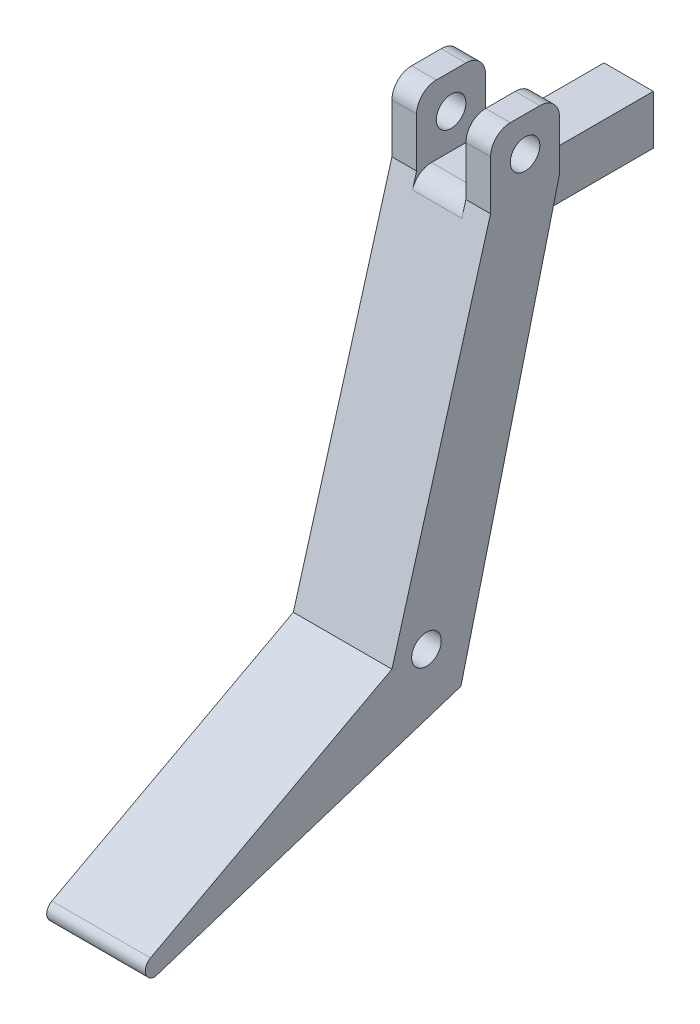
ISO-10303-21;
HEADER;
FILE_DESCRIPTION(('STEP AP214'),'2;1');
FILE_NAME('part.step','',(''),(''),'','','');
FILE_SCHEMA(('AUTOMOTIVE_DESIGN { 1 0 10303 214 1 1 1 1 }'));
ENDSEC;
DATA;
#1=APPLICATION_CONTEXT('core data for automotive mechanical design processes');
#2=APPLICATION_PROTOCOL_DEFINITION('international standard','automotive_design',2000,#1);
#3=PRODUCT_CONTEXT('',#1,'mechanical');
#4=PRODUCT('Part','Part','',(#3));
#5=PRODUCT_RELATED_PRODUCT_CATEGORY('part','',(#4));
#6=PRODUCT_DEFINITION_FORMATION('','',#4);
#7=PRODUCT_DEFINITION_CONTEXT('part definition',#1,'design');
#8=PRODUCT_DEFINITION('design','',#6,#7);
#9=PRODUCT_DEFINITION_SHAPE('','',#8);
#10=(LENGTH_UNIT() NAMED_UNIT(*) SI_UNIT(.MILLI.,.METRE.));
#11=(NAMED_UNIT(*) PLANE_ANGLE_UNIT() SI_UNIT($,.RADIAN.));
#12=(NAMED_UNIT(*) SI_UNIT($,.STERADIAN.) SOLID_ANGLE_UNIT());
#13=UNCERTAINTY_MEASURE_WITH_UNIT(LENGTH_MEASURE(1.E-05),#10,'distance_accuracy_value','');
#14=(GEOMETRIC_REPRESENTATION_CONTEXT(3) GLOBAL_UNCERTAINTY_ASSIGNED_CONTEXT((#13)) GLOBAL_UNIT_ASSIGNED_CONTEXT((#10,
#11,#12)) REPRESENTATION_CONTEXT('',''));
#15=CARTESIAN_POINT('',(0.,0.,0.));
#16=DIRECTION('',(0.,0.,1.));
#17=DIRECTION('',(1.,0.,0.));
#18=AXIS2_PLACEMENT_3D('',#15,#16,#17);
#19=CARTESIAN_POINT('',(10.,32.7058823529412,-7.1764705882353));
#20=DIRECTION('',(0.,0.,1.));
#21=DIRECTION('',(1.,0.,0.));
#22=AXIS2_PLACEMENT_3D('',#19,#20,#21);
#23=PLANE('',#22);
#24=DIRECTION('',(0.,1.,0.));
#25=VECTOR('',#24,1.);
#26=CARTESIAN_POINT('',(7.5,32.7058823529412,-7.1764705882353));
#27=LINE('',#26,#25);
#28=CARTESIAN_POINT('',(7.5,32.7058823529412,-7.1764705882353));
#29=VERTEX_POINT('',#28);
#30=CARTESIAN_POINT('',(7.5,37.7058823529412,-7.1764705882353));
#31=VERTEX_POINT('',#30);
#32=EDGE_CURVE('E228',#29,#31,#27,.T.);
#33=ORIENTED_EDGE('',*,*,#32,.T.);
#34=DIRECTION('',(-1.,0.,0.));
#35=VECTOR('',#34,1.);
#36=CARTESIAN_POINT('',(10.,37.7058823529412,-7.1764705882353));
#37=LINE('',#36,#35);
#38=CARTESIAN_POINT('',(10.,37.7058823529412,-7.1764705882353));
#39=VERTEX_POINT('',#38);
#40=EDGE_CURVE('E337',#31,#39,#37,.F.);
#41=ORIENTED_EDGE('',*,*,#40,.T.);
#42=DIRECTION('',(0.,1.,0.));
#43=VECTOR('',#42,1.);
#44=CARTESIAN_POINT('',(10.,32.7058823529412,-7.1764705882353));
#45=LINE('',#44,#43);
#46=CARTESIAN_POINT('',(10.,32.7058823529412,-7.1764705882353));
#47=VERTEX_POINT('',#46);
#48=EDGE_CURVE('E262',#47,#39,#45,.T.);
#49=ORIENTED_EDGE('',*,*,#48,.F.);
#50=DIRECTION('',(-1.,0.,0.));
#51=VECTOR('',#50,1.);
#52=CARTESIAN_POINT('',(10.,32.7058823529412,-7.1764705882353));
#53=LINE('',#52,#51);
#54=EDGE_CURVE('E293',#47,#29,#53,.T.);
#55=ORIENTED_EDGE('',*,*,#54,.T.);
#56=EDGE_LOOP('',(#33,#41,#49,#55));
#57=FACE_BOUND('',#56,.T.);
#58=ADVANCED_FACE('F35',(#57),#23,.F.);
#59=CARTESIAN_POINT('',(10.,39.7058823529412,-7.1764705882353));
#60=DIRECTION('',(0.,-1.,0.));
#61=DIRECTION('',(0.,0.,-1.));
#62=AXIS2_PLACEMENT_3D('',#59,#60,#61);
#63=PLANE('',#62);
#64=DIRECTION('',(0.,0.,-1.));
#65=VECTOR('',#64,1.);
#66=CARTESIAN_POINT('',(7.5,39.7058823529412,-0.176470588235299));
#67=LINE('',#66,#65);
#68=CARTESIAN_POINT('',(7.5,39.7058823529412,-2.1764705882353));
#69=VERTEX_POINT('',#68);
#70=CARTESIAN_POINT('',(7.5,39.7058823529412,-5.1764705882353));
#71=VERTEX_POINT('',#70);
#72=EDGE_CURVE('E220',#69,#71,#67,.T.);
#73=ORIENTED_EDGE('',*,*,#72,.F.);
#74=DIRECTION('',(-1.,0.,0.));
#75=VECTOR('',#74,1.);
#76=CARTESIAN_POINT('',(10.,39.7058823529412,-2.1764705882353));
#77=LINE('',#76,#75);
#78=CARTESIAN_POINT('',(10.,39.7058823529412,-2.1764705882353));
#79=VERTEX_POINT('',#78);
#80=EDGE_CURVE('E331',#69,#79,#77,.F.);
#81=ORIENTED_EDGE('',*,*,#80,.T.);
#82=DIRECTION('',(0.,0.,1.));
#83=VECTOR('',#82,1.);
#84=CARTESIAN_POINT('',(10.,39.7058823529412,-7.1764705882353));
#85=LINE('',#84,#83);
#86=CARTESIAN_POINT('',(10.,39.7058823529412,-5.1764705882353));
#87=VERTEX_POINT('',#86);
#88=EDGE_CURVE('E265',#87,#79,#85,.T.);
#89=ORIENTED_EDGE('',*,*,#88,.F.);
#90=DIRECTION('',(-1.,0.,0.));
#91=VECTOR('',#90,1.);
#92=CARTESIAN_POINT('',(10.,39.7058823529412,-5.1764705882353));
#93=LINE('',#92,#91);
#94=EDGE_CURVE('E328',#87,#71,#93,.T.);
#95=ORIENTED_EDGE('',*,*,#94,.T.);
#96=EDGE_LOOP('',(#73,#81,#89,#95));
#97=FACE_BOUND('',#96,.T.);
#98=ADVANCED_FACE('F386',(#97),#63,.F.);
#99=CARTESIAN_POINT('',(10.,39.7058823529412,-0.176470588235299));
#100=DIRECTION('',(0.,0.,-1.));
#101=DIRECTION('',(0.,1.,0.));
#102=AXIS2_PLACEMENT_3D('',#99,#100,#101);
#103=PLANE('',#102);
#104=DIRECTION('',(0.,-1.,0.));
#105=VECTOR('',#104,1.);
#106=CARTESIAN_POINT('',(10.,39.7058823529412,-0.176470588235299));
#107=LINE('',#106,#105);
#108=CARTESIAN_POINT('',(10.,37.7058823529412,-0.176470588235298));
#109=VERTEX_POINT('',#108);
#110=CARTESIAN_POINT('',(10.,32.7058823529412,-0.176470588235297));
#111=VERTEX_POINT('',#110);
#112=EDGE_CURVE('E268',#109,#111,#107,.T.);
#113=ORIENTED_EDGE('',*,*,#112,.F.);
#114=DIRECTION('',(-1.,0.,0.));
#115=VECTOR('',#114,1.);
#116=CARTESIAN_POINT('',(10.,37.7058823529412,-0.176470588235298));
#117=LINE('',#116,#115);
#118=CARTESIAN_POINT('',(7.5,37.7058823529412,-0.176470588235299));
#119=VERTEX_POINT('',#118);
#120=EDGE_CURVE('E321',#109,#119,#117,.T.);
#121=ORIENTED_EDGE('',*,*,#120,.T.);
#122=DIRECTION('',(0.,1.,0.));
#123=VECTOR('',#122,1.);
#124=CARTESIAN_POINT('',(7.5,32.7058823529412,-0.176470588235299));
#125=LINE('',#124,#123);
#126=CARTESIAN_POINT('',(7.5,32.7058823529412,-0.176470588235299));
#127=VERTEX_POINT('',#126);
#128=EDGE_CURVE('E232',#127,#119,#125,.T.);
#129=ORIENTED_EDGE('',*,*,#128,.F.);
#130=DIRECTION('',(-1.,0.,0.));
#131=VECTOR('',#130,1.);
#132=CARTESIAN_POINT('',(10.,32.7058823529412,-0.176470588235297));
#133=LINE('',#132,#131);
#134=EDGE_CURVE('E290',#111,#127,#133,.T.);
#135=ORIENTED_EDGE('',*,*,#134,.F.);
#136=EDGE_LOOP('',(#113,#121,#129,#135));
#137=FACE_BOUND('',#136,.T.);
#138=ADVANCED_FACE('F380',(#137),#103,.F.);
#139=CARTESIAN_POINT('',(10.,36.2058823529412,-3.6764705882353));
#140=DIRECTION('',(-1.,0.,0.));
#141=DIRECTION('',(0.,0.,1.));
#142=AXIS2_PLACEMENT_3D('',#139,#140,#141);
#143=CYLINDRICAL_SURFACE('',#142,1.5);
#144=CARTESIAN_POINT('',(7.5,36.2058823529412,-3.6764705882353));
#145=DIRECTION('',(1.,0.,0.));
#146=DIRECTION('',(0.,0.,-1.));
#147=AXIS2_PLACEMENT_3D('',#144,#145,#146);
#148=CIRCLE('',#147,1.5);
#149=CARTESIAN_POINT('',(7.5,36.2058823529412,-5.1764705882353));
#150=VERTEX_POINT('',#149);
#151=EDGE_CURVE('E249',#150,#150,#148,.T.);
#152=ORIENTED_EDGE('',*,*,#151,.F.);
#153=EDGE_LOOP('',(#152));
#154=FACE_BOUND('',#153,.T.);
#155=CARTESIAN_POINT('',(10.,36.2058823529412,-3.6764705882353));
#156=DIRECTION('',(1.,0.,0.));
#157=DIRECTION('',(0.,0.,-1.));
#158=AXIS2_PLACEMENT_3D('',#155,#156,#157);
#159=CIRCLE('',#158,1.5);
#160=CARTESIAN_POINT('',(10.,36.2058823529412,-5.1764705882353));
#161=VERTEX_POINT('',#160);
#162=EDGE_CURVE('E250',#161,#161,#159,.T.);
#163=ORIENTED_EDGE('',*,*,#162,.T.);
#164=EDGE_LOOP('',(#163));
#165=FACE_BOUND('',#164,.T.);
#166=ADVANCED_FACE('F490',(#154,#165),#143,.F.);
#167=CARTESIAN_POINT('',(10.,0.,0.));
#168=DIRECTION('',(-1.,0.,0.));
#169=DIRECTION('',(0.,0.,1.));
#170=AXIS2_PLACEMENT_3D('',#167,#168,#169);
#171=PLANE('',#170);
#172=ORIENTED_EDGE('',*,*,#162,.F.);
#173=EDGE_LOOP('',(#172));
#174=FACE_BOUND('',#173,.T.);
#175=CARTESIAN_POINT('',(10.,-16.2941176470588,33.8392120551956));
#176=DIRECTION('',(-1.,0.,0.));
#177=DIRECTION('',(0.,0.,1.));
#178=AXIS2_PLACEMENT_3D('',#175,#176,#177);
#179=CIRCLE('',#178,1.);
#180=CARTESIAN_POINT('',(10.,-15.41263767703,34.311433467711));
#181=VERTEX_POINT('',#180);
#182=CARTESIAN_POINT('',(10.,-17.2941176470588,33.8392120551956));
#183=VERTEX_POINT('',#182);
#184=EDGE_CURVE('E305',#181,#183,#179,.F.);
#185=ORIENTED_EDGE('',*,*,#184,.T.);
#186=DIRECTION('',(0.,-0.30686216892908,0.951753964677921));
#187=VECTOR('',#186,1.);
#188=CARTESIAN_POINT('',(10.,-17.2941176470588,33.8392120551956));
#189=LINE('',#188,#187);
#190=CARTESIAN_POINT('',(10.,-7.29411764705882,2.82352941176469));
#191=VERTEX_POINT('',#190);
#192=EDGE_CURVE('E216',#191,#183,#189,.T.);
#193=ORIENTED_EDGE('',*,*,#192,.F.);
#194=DIRECTION('',(0.,0.970142500145332,-0.242535625036333));
#195=VECTOR('',#194,1.);
#196=CARTESIAN_POINT('',(10.,-7.29411764705882,2.82352941176469));
#197=LINE('',#196,#195);
#198=EDGE_CURVE('E259',#191,#47,#197,.T.);
#199=ORIENTED_EDGE('',*,*,#198,.T.);
#200=ORIENTED_EDGE('',*,*,#48,.T.);
#201=CARTESIAN_POINT('',(10.,37.7058823529412,-5.1764705882353));
#202=DIRECTION('',(-1.,0.,0.));
#203=DIRECTION('',(0.,0.,1.));
#204=AXIS2_PLACEMENT_3D('',#201,#202,#203);
#205=CIRCLE('',#204,2.);
#206=EDGE_CURVE('E333',#39,#87,#205,.F.);
#207=ORIENTED_EDGE('',*,*,#206,.T.);
#208=ORIENTED_EDGE('',*,*,#88,.T.);
#209=CARTESIAN_POINT('',(10.,37.7058823529412,-2.1764705882353));
#210=DIRECTION('',(-1.,0.,0.));
#211=DIRECTION('',(0.,0.,1.));
#212=AXIS2_PLACEMENT_3D('',#209,#210,#211);
#213=CIRCLE('',#212,2.);
#214=EDGE_CURVE('E335',#79,#109,#213,.F.);
#215=ORIENTED_EDGE('',*,*,#214,.T.);
#216=ORIENTED_EDGE('',*,*,#112,.T.);
#217=DIRECTION('',(0.,-0.961523947640823,0.274721127897378));
#218=VECTOR('',#217,1.);
#219=CARTESIAN_POINT('',(10.,32.7058823529412,-0.176470588235297));
#220=LINE('',#219,#218);
#221=CARTESIAN_POINT('',(10.,-2.29411764705882,9.8235294117647));
#222=VERTEX_POINT('',#221);
#223=EDGE_CURVE('E270',#111,#222,#220,.T.);
#224=ORIENTED_EDGE('',*,*,#223,.T.);
#225=DIRECTION('',(0.,-0.472221412515419,0.881479970028782));
#226=VECTOR('',#225,1.);
#227=CARTESIAN_POINT('',(10.,-2.29411764705882,9.8235294117647));
#228=LINE('',#227,#226);
#229=EDGE_CURVE('E256',#222,#181,#228,.T.);
#230=ORIENTED_EDGE('',*,*,#229,.T.);
#231=EDGE_LOOP('',(#185,#193,#199,#200,#207,#208,#215,#216,#224,#230));
#232=FACE_BOUND('',#231,.T.);
#233=CARTESIAN_POINT('',(10.,-2.29411764705882,6.32352941176469));
#234=DIRECTION('',(1.,0.,0.));
#235=DIRECTION('',(0.,0.,-1.));
#236=AXIS2_PLACEMENT_3D('',#233,#234,#235);
#237=CIRCLE('',#236,1.5);
#238=CARTESIAN_POINT('',(10.,-2.29411764705882,4.82352941176469));
#239=VERTEX_POINT('',#238);
#240=EDGE_CURVE('E242',#239,#239,#237,.T.);
#241=ORIENTED_EDGE('',*,*,#240,.F.);
#242=EDGE_LOOP('',(#241));
#243=FACE_BOUND('',#242,.T.);
#244=ADVANCED_FACE('F392',(#174,#232,#243),#171,.F.);
#245=CARTESIAN_POINT('',(0.,0.,0.));
#246=DIRECTION('',(-1.,0.,0.));
#247=DIRECTION('',(0.,0.,1.));
#248=AXIS2_PLACEMENT_3D('',#245,#246,#247);
#249=PLANE('',#248);
#250=DIRECTION('',(0.,0.30686216892908,-0.951753964677921));
#251=VECTOR('',#250,1.);
#252=CARTESIAN_POINT('',(0.,-5.78263916635985,-1.86442427620874));
#253=LINE('',#252,#251);
#254=CARTESIAN_POINT('',(0.,-17.2941176470588,33.8392120551956));
#255=VERTEX_POINT('',#254);
#256=CARTESIAN_POINT('',(0.,-7.29411764705882,2.82352941176469));
#257=VERTEX_POINT('',#256);
#258=EDGE_CURVE('E218',#255,#257,#253,.T.);
#259=ORIENTED_EDGE('',*,*,#258,.F.);
#260=CARTESIAN_POINT('',(0.,-16.2941176470588,33.8392120551956));
#261=DIRECTION('',(-1.,0.,0.));
#262=DIRECTION('',(0.,0.,1.));
#263=AXIS2_PLACEMENT_3D('',#260,#261,#262);
#264=CIRCLE('',#263,1.);
#265=CARTESIAN_POINT('',(0.,-15.41263767703,34.311433467711));
#266=VERTEX_POINT('',#265);
#267=EDGE_CURVE('E301',#255,#266,#264,.T.);
#268=ORIENTED_EDGE('',*,*,#267,.T.);
#269=DIRECTION('',(0.,-0.472221412515419,0.881479970028782));
#270=VECTOR('',#269,1.);
#271=CARTESIAN_POINT('',(0.,-2.29411764705882,9.8235294117647));
#272=LINE('',#271,#270);
#273=CARTESIAN_POINT('',(0.,-2.29411764705882,9.8235294117647));
#274=VERTEX_POINT('',#273);
#275=EDGE_CURVE('E253',#274,#266,#272,.T.);
#276=ORIENTED_EDGE('',*,*,#275,.F.);
#277=DIRECTION('',(0.,-0.961523947640823,0.274721127897378));
#278=VECTOR('',#277,1.);
#279=CARTESIAN_POINT('',(0.,32.7058823529412,-0.176470588235297));
#280=LINE('',#279,#278);
#281=CARTESIAN_POINT('',(0.,32.7058823529412,-0.176470588235297));
#282=VERTEX_POINT('',#281);
#283=EDGE_CURVE('E260',#282,#274,#280,.T.);
#284=ORIENTED_EDGE('',*,*,#283,.F.);
#285=DIRECTION('',(0.,-1.,0.));
#286=VECTOR('',#285,1.);
#287=CARTESIAN_POINT('',(0.,39.7058823529412,-0.176470588235299));
#288=LINE('',#287,#286);
#289=CARTESIAN_POINT('',(0.,37.7058823529412,-0.176470588235298));
#290=VERTEX_POINT('',#289);
#291=EDGE_CURVE('E284',#290,#282,#288,.T.);
#292=ORIENTED_EDGE('',*,*,#291,.F.);
#293=CARTESIAN_POINT('',(0.,37.7058823529412,-2.1764705882353));
#294=DIRECTION('',(-1.,0.,0.));
#295=DIRECTION('',(0.,0.,1.));
#296=AXIS2_PLACEMENT_3D('',#293,#294,#295);
#297=CIRCLE('',#296,2.);
#298=CARTESIAN_POINT('',(0.,39.7058823529412,-2.1764705882353));
#299=VERTEX_POINT('',#298);
#300=EDGE_CURVE('E344',#290,#299,#297,.T.);
#301=ORIENTED_EDGE('',*,*,#300,.T.);
#302=DIRECTION('',(0.,0.,1.));
#303=VECTOR('',#302,1.);
#304=CARTESIAN_POINT('',(0.,39.7058823529412,-7.1764705882353));
#305=LINE('',#304,#303);
#306=CARTESIAN_POINT('',(0.,39.7058823529412,-5.1764705882353));
#307=VERTEX_POINT('',#306);
#308=EDGE_CURVE('E281',#307,#299,#305,.T.);
#309=ORIENTED_EDGE('',*,*,#308,.F.);
#310=CARTESIAN_POINT('',(0.,37.7058823529412,-5.1764705882353));
#311=DIRECTION('',(-1.,0.,0.));
#312=DIRECTION('',(0.,0.,1.));
#313=AXIS2_PLACEMENT_3D('',#310,#311,#312);
#314=CIRCLE('',#313,2.);
#315=CARTESIAN_POINT('',(0.,37.7058823529412,-7.1764705882353));
#316=VERTEX_POINT('',#315);
#317=EDGE_CURVE('E346',#307,#316,#314,.T.);
#318=ORIENTED_EDGE('',*,*,#317,.T.);
#319=DIRECTION('',(0.,1.,0.));
#320=VECTOR('',#319,1.);
#321=CARTESIAN_POINT('',(0.,32.7058823529412,-7.1764705882353));
#322=LINE('',#321,#320);
#323=CARTESIAN_POINT('',(0.,32.7058823529412,-7.1764705882353));
#324=VERTEX_POINT('',#323);
#325=EDGE_CURVE('E278',#324,#316,#322,.T.);
#326=ORIENTED_EDGE('',*,*,#325,.F.);
#327=DIRECTION('',(0.,0.970142500145332,-0.242535625036333));
#328=VECTOR('',#327,1.);
#329=CARTESIAN_POINT('',(0.,-7.29411764705882,2.82352941176469));
#330=LINE('',#329,#328);
#331=EDGE_CURVE('E275',#257,#324,#330,.T.);
#332=ORIENTED_EDGE('',*,*,#331,.F.);
#333=EDGE_LOOP('',(#259,#268,#276,#284,#292,#301,#309,#318,#326,#332));
#334=FACE_BOUND('',#333,.T.);
#335=CARTESIAN_POINT('',(0.,36.2058823529412,-3.6764705882353));
#336=DIRECTION('',(1.,0.,0.));
#337=DIRECTION('',(0.,0.,-1.));
#338=AXIS2_PLACEMENT_3D('',#335,#336,#337);
#339=CIRCLE('',#338,1.5);
#340=CARTESIAN_POINT('',(0.,36.2058823529412,-5.1764705882353));
#341=VERTEX_POINT('',#340);
#342=EDGE_CURVE('E245',#341,#341,#339,.T.);
#343=ORIENTED_EDGE('',*,*,#342,.T.);
#344=EDGE_LOOP('',(#343));
#345=FACE_BOUND('',#344,.T.);
#346=CARTESIAN_POINT('',(0.,-2.29411764705882,6.32352941176469));
#347=DIRECTION('',(1.,0.,0.));
#348=DIRECTION('',(0.,0.,-1.));
#349=AXIS2_PLACEMENT_3D('',#346,#347,#348);
#350=CIRCLE('',#349,1.5);
#351=CARTESIAN_POINT('',(0.,-2.29411764705882,4.82352941176469));
#352=VERTEX_POINT('',#351);
#353=EDGE_CURVE('E246',#352,#352,#350,.T.);
#354=ORIENTED_EDGE('',*,*,#353,.T.);
#355=EDGE_LOOP('',(#354));
#356=FACE_BOUND('',#355,.T.);
#357=ADVANCED_FACE('F456',(#334,#345,#356),#249,.T.);
#358=CARTESIAN_POINT('',(10.,-2.29411764705882,9.8235294117647));
#359=DIRECTION('',(0.,-0.881479970028782,-0.472221412515419));
#360=DIRECTION('',(0.,0.472221412515419,-0.881479970028782));
#361=AXIS2_PLACEMENT_3D('',#358,#359,#360);
#362=PLANE('',#361);
#363=ORIENTED_EDGE('',*,*,#275,.T.);
#364=DIRECTION('',(-1.,0.,0.));
#365=VECTOR('',#364,1.);
#366=CARTESIAN_POINT('',(10.,-15.41263767703,34.311433467711));
#367=LINE('',#366,#365);
#368=EDGE_CURVE('E303',#266,#181,#367,.F.);
#369=ORIENTED_EDGE('',*,*,#368,.T.);
#370=ORIENTED_EDGE('',*,*,#229,.F.);
#371=DIRECTION('',(-1.,0.,0.));
#372=VECTOR('',#371,1.);
#373=CARTESIAN_POINT('',(10.,-2.29411764705882,9.8235294117647));
#374=LINE('',#373,#372);
#375=EDGE_CURVE('E272',#222,#274,#374,.T.);
#376=ORIENTED_EDGE('',*,*,#375,.T.);
#377=EDGE_LOOP('',(#363,#369,#370,#376));
#378=FACE_BOUND('',#377,.T.);
#379=ADVANCED_FACE('F436',(#378),#362,.F.);
#380=CARTESIAN_POINT('',(10.,-7.29411764705882,2.82352941176469));
#381=DIRECTION('',(0.,0.242535625036333,0.970142500145332));
#382=DIRECTION('',(0.,-0.970142500145332,0.242535625036333));
#383=AXIS2_PLACEMENT_3D('',#380,#381,#382);
#384=PLANE('',#383);
#385=CARTESIAN_POINT('',(2.5,32.7058823529412,-7.1764705882353));
#386=VERTEX_POINT('',#385);
#387=EDGE_CURVE('E292',#386,#324,#53,.T.);
#388=ORIENTED_EDGE('',*,*,#387,.F.);
#389=DIRECTION('',(0.,-0.970142500145332,0.242535625036333));
#390=VECTOR('',#389,1.);
#391=CARTESIAN_POINT('',(2.5,-7.29411764705882,2.82352941176469));
#392=LINE('',#391,#390);
#393=CARTESIAN_POINT('',(2.5,27.7058823529412,-5.9264705882353));
#394=VERTEX_POINT('',#393);
#395=EDGE_CURVE('E213',#386,#394,#392,.T.);
#396=ORIENTED_EDGE('',*,*,#395,.T.);
#397=DIRECTION('',(1.,0.,0.));
#398=VECTOR('',#397,1.);
#399=CARTESIAN_POINT('',(10.,27.7058823529412,-5.9264705882353));
#400=LINE('',#399,#398);
#401=CARTESIAN_POINT('',(7.5,27.7058823529412,-5.9264705882353));
#402=VERTEX_POINT('',#401);
#403=EDGE_CURVE('E11',#394,#402,#400,.T.);
#404=ORIENTED_EDGE('',*,*,#403,.T.);
#405=DIRECTION('',(0.,0.970142500145332,-0.242535625036333));
#406=VECTOR('',#405,1.);
#407=CARTESIAN_POINT('',(7.5,-7.29411764705882,2.82352941176469));
#408=LINE('',#407,#406);
#409=EDGE_CURVE('E187',#402,#29,#408,.T.);
#410=ORIENTED_EDGE('',*,*,#409,.T.);
#411=ORIENTED_EDGE('',*,*,#54,.F.);
#412=ORIENTED_EDGE('',*,*,#198,.F.);
#413=DIRECTION('',(-1.,0.,0.));
#414=VECTOR('',#413,1.);
#415=CARTESIAN_POINT('',(10.,-7.29411764705882,2.82352941176469));
#416=LINE('',#415,#414);
#417=EDGE_CURVE('E296',#191,#257,#416,.T.);
#418=ORIENTED_EDGE('',*,*,#417,.T.);
#419=ORIENTED_EDGE('',*,*,#331,.T.);
#420=EDGE_LOOP('',(#388,#396,#404,#410,#411,#412,#418,#419));
#421=FACE_BOUND('',#420,.T.);
#422=ADVANCED_FACE('F404',(#421),#384,.F.);
#423=ORIENTED_EDGE('',*,*,#325,.T.);
#424=DIRECTION('',(-1.,0.,0.));
#425=VECTOR('',#424,1.);
#426=CARTESIAN_POINT('',(10.,37.7058823529412,-7.1764705882353));
#427=LINE('',#426,#425);
#428=CARTESIAN_POINT('',(2.5,37.7058823529412,-7.1764705882353));
#429=VERTEX_POINT('',#428);
#430=EDGE_CURVE('E348',#316,#429,#427,.F.);
#431=ORIENTED_EDGE('',*,*,#430,.T.);
#432=DIRECTION('',(0.,1.,0.));
#433=VECTOR('',#432,1.);
#434=CARTESIAN_POINT('',(2.5,32.7058823529412,-7.1764705882353));
#435=LINE('',#434,#433);
#436=EDGE_CURVE('E237',#386,#429,#435,.T.);
#437=ORIENTED_EDGE('',*,*,#436,.F.);
#438=ORIENTED_EDGE('',*,*,#387,.T.);
#439=EDGE_LOOP('',(#423,#431,#437,#438));
#440=FACE_BOUND('',#439,.T.);
#441=ADVANCED_FACE('F419',(#440),#23,.F.);
#442=DIRECTION('',(0.,0.,1.));
#443=VECTOR('',#442,1.);
#444=CARTESIAN_POINT('',(2.5,39.7058823529412,-0.176470588235298));
#445=LINE('',#444,#443);
#446=CARTESIAN_POINT('',(2.5,39.7058823529412,-5.1764705882353));
#447=VERTEX_POINT('',#446);
#448=CARTESIAN_POINT('',(2.5,39.7058823529412,-2.1764705882353));
#449=VERTEX_POINT('',#448);
#450=EDGE_CURVE('E225',#447,#449,#445,.T.);
#451=ORIENTED_EDGE('',*,*,#450,.F.);
#452=DIRECTION('',(-1.,0.,0.));
#453=VECTOR('',#452,1.);
#454=CARTESIAN_POINT('',(10.,39.7058823529412,-5.1764705882353));
#455=LINE('',#454,#453);
#456=EDGE_CURVE('E341',#447,#307,#455,.T.);
#457=ORIENTED_EDGE('',*,*,#456,.T.);
#458=ORIENTED_EDGE('',*,*,#308,.T.);
#459=DIRECTION('',(-1.,0.,0.));
#460=VECTOR('',#459,1.);
#461=CARTESIAN_POINT('',(10.,39.7058823529412,-2.1764705882353));
#462=LINE('',#461,#460);
#463=EDGE_CURVE('E339',#299,#449,#462,.F.);
#464=ORIENTED_EDGE('',*,*,#463,.T.);
#465=EDGE_LOOP('',(#451,#457,#458,#464));
#466=FACE_BOUND('',#465,.T.);
#467=ADVANCED_FACE('F426',(#466),#63,.F.);
#468=DIRECTION('',(0.,1.,0.));
#469=VECTOR('',#468,1.);
#470=CARTESIAN_POINT('',(2.5,32.7058823529412,-0.176470588235298));
#471=LINE('',#470,#469);
#472=CARTESIAN_POINT('',(2.5,32.7058823529412,-0.176470588235297));
#473=VERTEX_POINT('',#472);
#474=CARTESIAN_POINT('',(2.5,37.7058823529412,-0.176470588235298));
#475=VERTEX_POINT('',#474);
#476=EDGE_CURVE('E235',#473,#475,#471,.T.);
#477=ORIENTED_EDGE('',*,*,#476,.T.);
#478=DIRECTION('',(-1.,0.,0.));
#479=VECTOR('',#478,1.);
#480=CARTESIAN_POINT('',(10.,37.7058823529412,-0.176470588235298));
#481=LINE('',#480,#479);
#482=EDGE_CURVE('E353',#475,#290,#481,.T.);
#483=ORIENTED_EDGE('',*,*,#482,.T.);
#484=ORIENTED_EDGE('',*,*,#291,.T.);
#485=EDGE_CURVE('E289',#473,#282,#133,.T.);
#486=ORIENTED_EDGE('',*,*,#485,.F.);
#487=EDGE_LOOP('',(#477,#483,#484,#486));
#488=FACE_BOUND('',#487,.T.);
#489=ADVANCED_FACE('F434',(#488),#103,.F.);
#490=CARTESIAN_POINT('',(10.,32.7058823529412,-0.176470588235297));
#491=DIRECTION('',(0.,-0.274721127897378,-0.961523947640823));
#492=DIRECTION('',(0.,0.961523947640823,-0.274721127897378));
#493=AXIS2_PLACEMENT_3D('',#490,#491,#492);
#494=PLANE('',#493);
#495=ORIENTED_EDGE('',*,*,#134,.T.);
#496=DIRECTION('',(0.,-0.961523947640823,0.274721127897378));
#497=VECTOR('',#496,1.);
#498=CARTESIAN_POINT('',(7.5,32.7058823529412,-0.176470588235297));
#499=LINE('',#498,#497);
#500=CARTESIAN_POINT('',(7.5,31.2553246087359,0.23797448153763));
#501=VERTEX_POINT('',#500);
#502=EDGE_CURVE('E50',#127,#501,#499,.T.);
#503=ORIENTED_EDGE('',*,*,#502,.T.);
#504=DIRECTION('',(1.,0.,0.));
#505=VECTOR('',#504,1.);
#506=CARTESIAN_POINT('',(2.5,31.2553246087359,0.23797448153763));
#507=LINE('',#506,#505);
#508=CARTESIAN_POINT('',(2.5,31.2553246087359,0.23797448153763));
#509=VERTEX_POINT('',#508);
#510=EDGE_CURVE('E317',#501,#509,#507,.F.);
#511=ORIENTED_EDGE('',*,*,#510,.T.);
#512=DIRECTION('',(0.,0.961523947640823,-0.274721127897378));
#513=VECTOR('',#512,1.);
#514=CARTESIAN_POINT('',(2.5,32.7058823529412,-0.176470588235297));
#515=LINE('',#514,#513);
#516=EDGE_CURVE('E315',#509,#473,#515,.T.);
#517=ORIENTED_EDGE('',*,*,#516,.T.);
#518=ORIENTED_EDGE('',*,*,#485,.T.);
#519=ORIENTED_EDGE('',*,*,#283,.T.);
#520=ORIENTED_EDGE('',*,*,#375,.F.);
#521=ORIENTED_EDGE('',*,*,#223,.F.);
#522=EDGE_LOOP('',(#495,#503,#511,#517,#518,#519,#520,#521));
#523=FACE_BOUND('',#522,.T.);
#524=ADVANCED_FACE('F373',(#523),#494,.F.);
#525=CARTESIAN_POINT('',(2.5,36.2058823529412,-3.6764705882353));
#526=DIRECTION('',(-1.,0.,0.));
#527=DIRECTION('',(0.,0.,1.));
#528=AXIS2_PLACEMENT_3D('',#525,#526,#527);
#529=CIRCLE('',#528,1.5);
#530=CARTESIAN_POINT('',(2.5,36.2058823529412,-2.1764705882353));
#531=VERTEX_POINT('',#530);
#532=EDGE_CURVE('E234',#531,#531,#529,.T.);
#533=ORIENTED_EDGE('',*,*,#532,.F.);
#534=EDGE_LOOP('',(#533));
#535=FACE_BOUND('',#534,.T.);
#536=ORIENTED_EDGE('',*,*,#342,.F.);
#537=EDGE_LOOP('',(#536));
#538=FACE_BOUND('',#537,.T.);
#539=ADVANCED_FACE('F485',(#535,#538),#143,.F.);
#540=CARTESIAN_POINT('',(10.,-2.29411764705882,6.32352941176469));
#541=DIRECTION('',(-1.,0.,0.));
#542=DIRECTION('',(0.,0.,1.));
#543=AXIS2_PLACEMENT_3D('',#540,#541,#542);
#544=CYLINDRICAL_SURFACE('',#543,1.5);
#545=ORIENTED_EDGE('',*,*,#240,.T.);
#546=EDGE_LOOP('',(#545));
#547=FACE_BOUND('',#546,.T.);
#548=ORIENTED_EDGE('',*,*,#353,.F.);
#549=EDGE_LOOP('',(#548));
#550=FACE_BOUND('',#549,.T.);
#551=ADVANCED_FACE('F482',(#547,#550),#544,.F.);
#552=CARTESIAN_POINT('',(10.,-16.2941176470588,33.8392120551956));
#553=DIRECTION('',(-1.,0.,0.));
#554=DIRECTION('',(0.,0.,1.));
#555=AXIS2_PLACEMENT_3D('',#552,#553,#554);
#556=CYLINDRICAL_SURFACE('',#555,1.);
#557=ORIENTED_EDGE('',*,*,#184,.F.);
#558=ORIENTED_EDGE('',*,*,#368,.F.);
#559=ORIENTED_EDGE('',*,*,#267,.F.);
#560=DIRECTION('',(-1.,0.,0.));
#561=VECTOR('',#560,1.);
#562=CARTESIAN_POINT('',(10.,-17.2941176470588,33.8392120551956));
#563=LINE('',#562,#561);
#564=EDGE_CURVE('E299',#183,#255,#563,.T.);
#565=ORIENTED_EDGE('',*,*,#564,.F.);
#566=EDGE_LOOP('',(#557,#558,#559,#565));
#567=FACE_BOUND('',#566,.T.);
#568=ADVANCED_FACE('F466',(#567),#556,.T.);
#569=CARTESIAN_POINT('',(7.5,32.7058823529412,-0.176470588235299));
#570=DIRECTION('',(1.,0.,0.));
#571=DIRECTION('',(0.,0.,-1.));
#572=AXIS2_PLACEMENT_3D('',#569,#570,#571);
#573=PLANE('',#572);
#574=ORIENTED_EDGE('',*,*,#151,.T.);
#575=EDGE_LOOP('',(#574));
#576=FACE_BOUND('',#575,.T.);
#577=ORIENTED_EDGE('',*,*,#128,.T.);
#578=CARTESIAN_POINT('',(7.5,37.7058823529412,-2.1764705882353));
#579=DIRECTION('',(1.,0.,0.));
#580=DIRECTION('',(0.,0.,-1.));
#581=AXIS2_PLACEMENT_3D('',#578,#579,#580);
#582=CIRCLE('',#581,2.);
#583=EDGE_CURVE('E326',#119,#69,#582,.F.);
#584=ORIENTED_EDGE('',*,*,#583,.T.);
#585=ORIENTED_EDGE('',*,*,#72,.T.);
#586=CARTESIAN_POINT('',(7.5,37.7058823529412,-5.1764705882353));
#587=DIRECTION('',(1.,0.,0.));
#588=DIRECTION('',(0.,0.,-1.));
#589=AXIS2_PLACEMENT_3D('',#586,#587,#588);
#590=CIRCLE('',#589,2.);
#591=EDGE_CURVE('E324',#71,#31,#590,.F.);
#592=ORIENTED_EDGE('',*,*,#591,.T.);
#593=ORIENTED_EDGE('',*,*,#32,.F.);
#594=DIRECTION('',(0.,0.,-1.));
#595=VECTOR('',#594,1.);
#596=CARTESIAN_POINT('',(7.5,32.7058823529412,-0.176470588235299));
#597=LINE('',#596,#595);
#598=CARTESIAN_POINT('',(7.5,32.7058823529412,-1.68507341374402));
#599=VERTEX_POINT('',#598);
#600=EDGE_CURVE('E221',#599,#29,#597,.T.);
#601=ORIENTED_EDGE('',*,*,#600,.F.);
#602=CARTESIAN_POINT('',(7.5,30.7058823529412,-1.68507341374402));
#603=DIRECTION('',(1.,0.,0.));
#604=DIRECTION('',(0.,0.,-1.));
#605=AXIS2_PLACEMENT_3D('',#602,#603,#604);
#606=CIRCLE('',#605,2.);
#607=EDGE_CURVE('E356',#599,#501,#606,.T.);
#608=ORIENTED_EDGE('',*,*,#607,.T.);
#609=ORIENTED_EDGE('',*,*,#502,.F.);
#610=EDGE_LOOP('',(#577,#584,#585,#592,#593,#601,#608,#609));
#611=FACE_BOUND('',#610,.T.);
#612=ADVANCED_FACE('F370',(#576,#611),#573,.F.);
#613=CARTESIAN_POINT('',(2.5,32.7058823529412,-0.176470588235298));
#614=DIRECTION('',(-1.,0.,0.));
#615=DIRECTION('',(0.,0.,1.));
#616=AXIS2_PLACEMENT_3D('',#613,#614,#615);
#617=PLANE('',#616);
#618=ORIENTED_EDGE('',*,*,#532,.T.);
#619=EDGE_LOOP('',(#618));
#620=FACE_BOUND('',#619,.T.);
#621=ORIENTED_EDGE('',*,*,#436,.T.);
#622=CARTESIAN_POINT('',(2.5,37.7058823529412,-5.1764705882353));
#623=DIRECTION('',(-1.,0.,0.));
#624=DIRECTION('',(0.,0.,1.));
#625=AXIS2_PLACEMENT_3D('',#622,#623,#624);
#626=CIRCLE('',#625,2.);
#627=EDGE_CURVE('E351',#429,#447,#626,.F.);
#628=ORIENTED_EDGE('',*,*,#627,.T.);
#629=ORIENTED_EDGE('',*,*,#450,.T.);
#630=CARTESIAN_POINT('',(2.5,37.7058823529412,-2.1764705882353));
#631=DIRECTION('',(-1.,0.,0.));
#632=DIRECTION('',(0.,0.,1.));
#633=AXIS2_PLACEMENT_3D('',#630,#631,#632);
#634=CIRCLE('',#633,2.);
#635=EDGE_CURVE('E58',#449,#475,#634,.F.);
#636=ORIENTED_EDGE('',*,*,#635,.T.);
#637=ORIENTED_EDGE('',*,*,#476,.F.);
#638=ORIENTED_EDGE('',*,*,#516,.F.);
#639=CARTESIAN_POINT('',(2.5,30.7058823529412,-1.68507341374402));
#640=DIRECTION('',(-1.,0.,0.));
#641=DIRECTION('',(0.,0.,1.));
#642=AXIS2_PLACEMENT_3D('',#639,#640,#641);
#643=CIRCLE('',#642,2.);
#644=CARTESIAN_POINT('',(2.5,32.7058823529412,-1.68507341374402));
#645=VERTEX_POINT('',#644);
#646=EDGE_CURVE('E43',#509,#645,#643,.T.);
#647=ORIENTED_EDGE('',*,*,#646,.T.);
#648=DIRECTION('',(0.,0.,1.));
#649=VECTOR('',#648,1.);
#650=CARTESIAN_POINT('',(2.5,32.7058823529412,-0.176470588235298));
#651=LINE('',#650,#649);
#652=EDGE_CURVE('E224',#386,#645,#651,.T.);
#653=ORIENTED_EDGE('',*,*,#652,.F.);
#654=EDGE_LOOP('',(#621,#628,#629,#636,#637,#638,#647,#653));
#655=FACE_BOUND('',#654,.T.);
#656=ADVANCED_FACE('F359',(#620,#655),#617,.F.);
#657=CARTESIAN_POINT('',(0.,32.7058823529412,0.));
#658=DIRECTION('',(0.,1.,0.));
#659=DIRECTION('',(0.,0.,1.));
#660=AXIS2_PLACEMENT_3D('',#657,#658,#659);
#661=PLANE('',#660);
#662=ORIENTED_EDGE('',*,*,#652,.T.);
#663=DIRECTION('',(1.,0.,0.));
#664=VECTOR('',#663,1.);
#665=CARTESIAN_POINT('',(7.5,32.7058823529412,-1.68507341374402));
#666=LINE('',#665,#664);
#667=EDGE_CURVE('E308',#645,#599,#666,.T.);
#668=ORIENTED_EDGE('',*,*,#667,.T.);
#669=ORIENTED_EDGE('',*,*,#600,.T.);
#670=DIRECTION('',(0.,0.,-1.));
#671=VECTOR('',#670,1.);
#672=CARTESIAN_POINT('',(7.5,32.7058823529412,-1.68507341374402));
#673=LINE('',#672,#671);
#674=CARTESIAN_POINT('',(7.5,32.7058823529412,-19.185073413744));
#675=VERTEX_POINT('',#674);
#676=EDGE_CURVE('E208',#29,#675,#673,.T.);
#677=ORIENTED_EDGE('',*,*,#676,.T.);
#678=DIRECTION('',(-1.,0.,0.));
#679=VECTOR('',#678,1.);
#680=CARTESIAN_POINT('',(2.5,32.7058823529412,-19.185073413744));
#681=LINE('',#680,#679);
#682=CARTESIAN_POINT('',(2.5,32.7058823529412,-19.185073413744));
#683=VERTEX_POINT('',#682);
#684=EDGE_CURVE('E197',#675,#683,#681,.T.);
#685=ORIENTED_EDGE('',*,*,#684,.T.);
#686=DIRECTION('',(0.,0.,1.));
#687=VECTOR('',#686,1.);
#688=CARTESIAN_POINT('',(2.5,32.7058823529412,-1.68507341374402));
#689=LINE('',#688,#687);
#690=EDGE_CURVE('E206',#683,#386,#689,.T.);
#691=ORIENTED_EDGE('',*,*,#690,.T.);
#692=EDGE_LOOP('',(#662,#668,#669,#677,#685,#691));
#693=FACE_BOUND('',#692,.T.);
#694=ADVANCED_FACE('F365',(#693),#661,.T.);
#695=CARTESIAN_POINT('',(0.,30.7058823529412,-1.68507341374402));
#696=DIRECTION('',(-1.,0.,0.));
#697=DIRECTION('',(0.,0.,1.));
#698=AXIS2_PLACEMENT_3D('',#695,#696,#697);
#699=CYLINDRICAL_SURFACE('',#698,2.);
#700=ORIENTED_EDGE('',*,*,#646,.F.);
#701=ORIENTED_EDGE('',*,*,#510,.F.);
#702=ORIENTED_EDGE('',*,*,#607,.F.);
#703=ORIENTED_EDGE('',*,*,#667,.F.);
#704=EDGE_LOOP('',(#700,#701,#702,#703));
#705=FACE_BOUND('',#704,.T.);
#706=ADVANCED_FACE('F369',(#705),#699,.T.);
#707=CARTESIAN_POINT('',(10.,37.7058823529412,-2.1764705882353));
#708=DIRECTION('',(-1.,0.,0.));
#709=DIRECTION('',(0.,0.,1.));
#710=AXIS2_PLACEMENT_3D('',#707,#708,#709);
#711=CYLINDRICAL_SURFACE('',#710,2.);
#712=ORIENTED_EDGE('',*,*,#214,.F.);
#713=ORIENTED_EDGE('',*,*,#80,.F.);
#714=ORIENTED_EDGE('',*,*,#583,.F.);
#715=ORIENTED_EDGE('',*,*,#120,.F.);
#716=EDGE_LOOP('',(#712,#713,#714,#715));
#717=FACE_BOUND('',#716,.T.);
#718=ADVANCED_FACE('F390',(#717),#711,.T.);
#719=CARTESIAN_POINT('',(10.,37.7058823529412,-5.1764705882353));
#720=DIRECTION('',(-1.,0.,0.));
#721=DIRECTION('',(0.,0.,1.));
#722=AXIS2_PLACEMENT_3D('',#719,#720,#721);
#723=CYLINDRICAL_SURFACE('',#722,2.);
#724=ORIENTED_EDGE('',*,*,#206,.F.);
#725=ORIENTED_EDGE('',*,*,#40,.F.);
#726=ORIENTED_EDGE('',*,*,#591,.F.);
#727=ORIENTED_EDGE('',*,*,#94,.F.);
#728=EDGE_LOOP('',(#724,#725,#726,#727));
#729=FACE_BOUND('',#728,.T.);
#730=ADVANCED_FACE('F396',(#729),#723,.T.);
#731=CARTESIAN_POINT('',(10.,37.7058823529412,-5.1764705882353));
#732=DIRECTION('',(-1.,0.,0.));
#733=DIRECTION('',(0.,0.,1.));
#734=AXIS2_PLACEMENT_3D('',#731,#732,#733);
#735=CYLINDRICAL_SURFACE('',#734,2.);
#736=ORIENTED_EDGE('',*,*,#627,.F.);
#737=ORIENTED_EDGE('',*,*,#430,.F.);
#738=ORIENTED_EDGE('',*,*,#317,.F.);
#739=ORIENTED_EDGE('',*,*,#456,.F.);
#740=EDGE_LOOP('',(#736,#737,#738,#739));
#741=FACE_BOUND('',#740,.T.);
#742=ADVANCED_FACE('F443',(#741),#735,.T.);
#743=CARTESIAN_POINT('',(10.,37.7058823529412,-2.1764705882353));
#744=DIRECTION('',(-1.,0.,0.));
#745=DIRECTION('',(0.,0.,1.));
#746=AXIS2_PLACEMENT_3D('',#743,#744,#745);
#747=CYLINDRICAL_SURFACE('',#746,2.);
#748=ORIENTED_EDGE('',*,*,#635,.F.);
#749=ORIENTED_EDGE('',*,*,#463,.F.);
#750=ORIENTED_EDGE('',*,*,#300,.F.);
#751=ORIENTED_EDGE('',*,*,#482,.F.);
#752=EDGE_LOOP('',(#748,#749,#750,#751));
#753=FACE_BOUND('',#752,.T.);
#754=ADVANCED_FACE('F37',(#753),#747,.T.);
#755=CARTESIAN_POINT('',(-10.,-17.2941176470588,33.8392120551956));
#756=DIRECTION('',(0.,0.951753964677921,0.30686216892908));
#757=DIRECTION('',(0.,-0.30686216892908,0.951753964677921));
#758=AXIS2_PLACEMENT_3D('',#755,#756,#757);
#759=PLANE('',#758);
#760=ORIENTED_EDGE('',*,*,#258,.T.);
#761=ORIENTED_EDGE('',*,*,#417,.F.);
#762=ORIENTED_EDGE('',*,*,#192,.T.);
#763=ORIENTED_EDGE('',*,*,#564,.T.);
#764=EDGE_LOOP('',(#760,#761,#762,#763));
#765=FACE_BOUND('',#764,.T.);
#766=ADVANCED_FACE('F414',(#765),#759,.F.);
#767=CARTESIAN_POINT('',(0.,27.7058823529412,0.));
#768=DIRECTION('',(0.,-1.,0.));
#769=DIRECTION('',(0.,0.,-1.));
#770=AXIS2_PLACEMENT_3D('',#767,#768,#769);
#771=PLANE('',#770);
#772=ORIENTED_EDGE('',*,*,#403,.F.);
#773=DIRECTION('',(0.,0.,1.));
#774=VECTOR('',#773,1.);
#775=CARTESIAN_POINT('',(2.5,27.7058823529412,-1.68507341374402));
#776=LINE('',#775,#774);
#777=CARTESIAN_POINT('',(2.5,27.7058823529412,-19.185073413744));
#778=VERTEX_POINT('',#777);
#779=EDGE_CURVE('E191',#778,#394,#776,.T.);
#780=ORIENTED_EDGE('',*,*,#779,.F.);
#781=DIRECTION('',(-1.,0.,0.));
#782=VECTOR('',#781,1.);
#783=CARTESIAN_POINT('',(2.5,27.7058823529412,-19.185073413744));
#784=LINE('',#783,#782);
#785=CARTESIAN_POINT('',(7.5,27.7058823529412,-19.185073413744));
#786=VERTEX_POINT('',#785);
#787=EDGE_CURVE('E190',#786,#778,#784,.T.);
#788=ORIENTED_EDGE('',*,*,#787,.F.);
#789=DIRECTION('',(0.,0.,-1.));
#790=VECTOR('',#789,1.);
#791=CARTESIAN_POINT('',(7.5,27.7058823529412,-1.68507341374402));
#792=LINE('',#791,#790);
#793=EDGE_CURVE('E181',#402,#786,#792,.T.);
#794=ORIENTED_EDGE('',*,*,#793,.F.);
#795=EDGE_LOOP('',(#772,#780,#788,#794));
#796=FACE_BOUND('',#795,.T.);
#797=ADVANCED_FACE('F201',(#796),#771,.T.);
#798=CARTESIAN_POINT('',(2.5,27.7058823529412,-1.68507341374402));
#799=DIRECTION('',(-1.,0.,0.));
#800=DIRECTION('',(0.,0.,1.));
#801=AXIS2_PLACEMENT_3D('',#798,#799,#800);
#802=PLANE('',#801);
#803=ORIENTED_EDGE('',*,*,#395,.F.);
#804=ORIENTED_EDGE('',*,*,#690,.F.);
#805=DIRECTION('',(0.,1.,0.));
#806=VECTOR('',#805,1.);
#807=CARTESIAN_POINT('',(2.5,27.7058823529412,-19.185073413744));
#808=LINE('',#807,#806);
#809=EDGE_CURVE('E198',#778,#683,#808,.T.);
#810=ORIENTED_EDGE('',*,*,#809,.F.);
#811=ORIENTED_EDGE('',*,*,#779,.T.);
#812=EDGE_LOOP('',(#803,#804,#810,#811));
#813=FACE_BOUND('',#812,.T.);
#814=ADVANCED_FACE('F406',(#813),#802,.T.);
#815=CARTESIAN_POINT('',(7.5,27.7058823529412,-1.68507341374402));
#816=DIRECTION('',(1.,0.,0.));
#817=DIRECTION('',(0.,0.,-1.));
#818=AXIS2_PLACEMENT_3D('',#815,#816,#817);
#819=PLANE('',#818);
#820=ORIENTED_EDGE('',*,*,#409,.F.);
#821=ORIENTED_EDGE('',*,*,#793,.T.);
#822=DIRECTION('',(0.,1.,0.));
#823=VECTOR('',#822,1.);
#824=CARTESIAN_POINT('',(7.5,27.7058823529412,-19.185073413744));
#825=LINE('',#824,#823);
#826=EDGE_CURVE('E184',#786,#675,#825,.T.);
#827=ORIENTED_EDGE('',*,*,#826,.T.);
#828=ORIENTED_EDGE('',*,*,#676,.F.);
#829=EDGE_LOOP('',(#820,#821,#827,#828));
#830=FACE_BOUND('',#829,.T.);
#831=ADVANCED_FACE('F183',(#830),#819,.T.);
#832=CARTESIAN_POINT('',(2.5,27.7058823529412,-19.185073413744));
#833=DIRECTION('',(0.,0.,-1.));
#834=DIRECTION('',(-1.,0.,0.));
#835=AXIS2_PLACEMENT_3D('',#832,#833,#834);
#836=PLANE('',#835);
#837=ORIENTED_EDGE('',*,*,#684,.F.);
#838=ORIENTED_EDGE('',*,*,#826,.F.);
#839=ORIENTED_EDGE('',*,*,#787,.T.);
#840=ORIENTED_EDGE('',*,*,#809,.T.);
#841=EDGE_LOOP('',(#837,#838,#839,#840));
#842=FACE_BOUND('',#841,.T.);
#843=ADVANCED_FACE('F195',(#842),#836,.T.);
#844=CLOSED_SHELL('',(#58,#98,#138,#166,#244,#357,#379,#422,#441,#467,#489,#524,#539,#551,#568,
#612,#656,#694,#706,#718,#730,#742,#754,#766,#797,#814,#831,#843));
#845=MANIFOLD_SOLID_BREP('B2',#844);
#846=ADVANCED_BREP_SHAPE_REPRESENTATION('',(#18,#845),#14);
#847=SHAPE_DEFINITION_REPRESENTATION(#9,#846);
ENDSEC;
END-ISO-10303-21;
